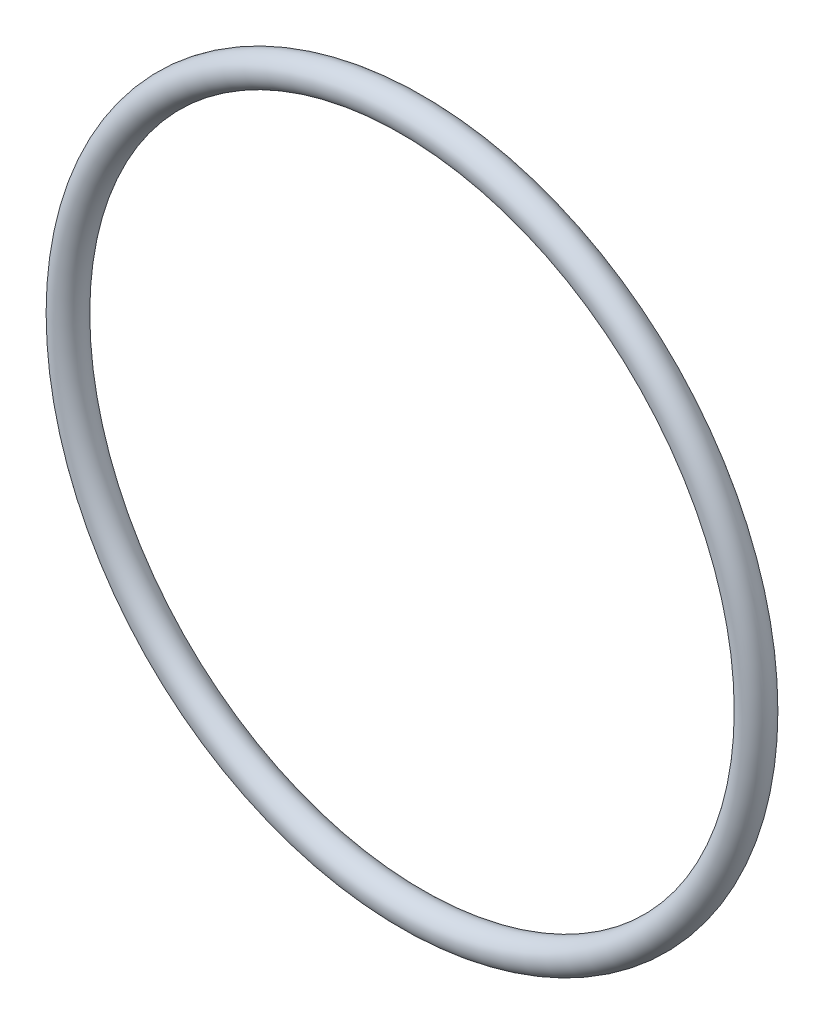
ISO-10303-21;
HEADER;
FILE_DESCRIPTION(('STEP AP214'),'2;1');
FILE_NAME('part.step','',(''),(''),'','','');
FILE_SCHEMA(('AUTOMOTIVE_DESIGN { 1 0 10303 214 1 1 1 1 }'));
ENDSEC;
DATA;
#1=APPLICATION_CONTEXT('core data for automotive mechanical design processes');
#2=APPLICATION_PROTOCOL_DEFINITION('international standard','automotive_design',2000,#1);
#3=PRODUCT_CONTEXT('',#1,'mechanical');
#4=PRODUCT('Part','Part','',(#3));
#5=PRODUCT_RELATED_PRODUCT_CATEGORY('part','',(#4));
#6=PRODUCT_DEFINITION_FORMATION('','',#4);
#7=PRODUCT_DEFINITION_CONTEXT('part definition',#1,'design');
#8=PRODUCT_DEFINITION('design','',#6,#7);
#9=PRODUCT_DEFINITION_SHAPE('','',#8);
#10=(LENGTH_UNIT() NAMED_UNIT(*) SI_UNIT(.MILLI.,.METRE.));
#11=(NAMED_UNIT(*) PLANE_ANGLE_UNIT() SI_UNIT($,.RADIAN.));
#12=(NAMED_UNIT(*) SI_UNIT($,.STERADIAN.) SOLID_ANGLE_UNIT());
#13=UNCERTAINTY_MEASURE_WITH_UNIT(LENGTH_MEASURE(1.E-05),#10,'distance_accuracy_value','');
#14=(GEOMETRIC_REPRESENTATION_CONTEXT(3) GLOBAL_UNCERTAINTY_ASSIGNED_CONTEXT((#13)) GLOBAL_UNIT_ASSIGNED_CONTEXT((#10,
#11,#12)) REPRESENTATION_CONTEXT('',''));
#15=CARTESIAN_POINT('',(0.,0.,0.));
#16=DIRECTION('',(0.,0.,1.));
#17=DIRECTION('',(1.,0.,0.));
#18=AXIS2_PLACEMENT_3D('',#15,#16,#17);
#19=CARTESIAN_POINT('',(0.,0.,0.));
#20=DIRECTION('',(0.,0.,1.));
#21=DIRECTION('',(1.,0.,0.));
#22=AXIS2_PLACEMENT_3D('',#19,#20,#21);
#23=TOROIDAL_SURFACE('',#22,19.7993,0.888999999999996);
#24=CARTESIAN_POINT('',(20.6883,0.,0.));
#25=VERTEX_POINT('',#24);
#26=VERTEX_LOOP('',#25);
#27=FACE_BOUND('',#26,.T.);
#28=ADVANCED_FACE('F33',(#27),#23,.T.);
#29=CLOSED_SHELL('',(#28));
#30=MANIFOLD_SOLID_BREP('B2',#29);
#31=ADVANCED_BREP_SHAPE_REPRESENTATION('',(#18,#30),#14);
#32=SHAPE_DEFINITION_REPRESENTATION(#9,#31);
ENDSEC;
END-ISO-10303-21;
